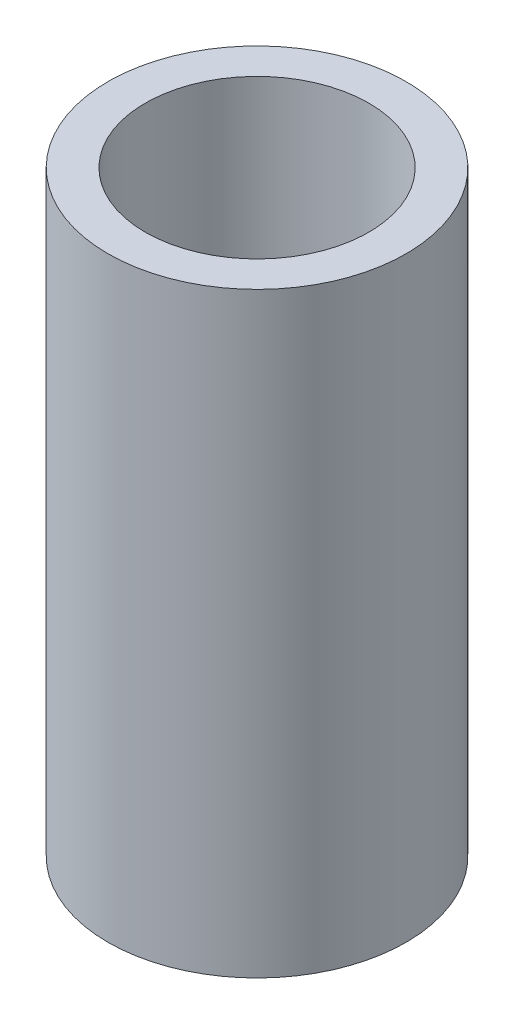
ISO-10303-21;
HEADER;
FILE_DESCRIPTION(('STEP AP214'),'2;1');
FILE_NAME('part.step','',(''),(''),'','','');
FILE_SCHEMA(('AUTOMOTIVE_DESIGN { 1 0 10303 214 1 1 1 1 }'));
ENDSEC;
DATA;
#1=APPLICATION_CONTEXT('core data for automotive mechanical design processes');
#2=APPLICATION_PROTOCOL_DEFINITION('international standard','automotive_design',2000,#1);
#3=PRODUCT_CONTEXT('',#1,'mechanical');
#4=PRODUCT('Part','Part','',(#3));
#5=PRODUCT_RELATED_PRODUCT_CATEGORY('part','',(#4));
#6=PRODUCT_DEFINITION_FORMATION('','',#4);
#7=PRODUCT_DEFINITION_CONTEXT('part definition',#1,'design');
#8=PRODUCT_DEFINITION('design','',#6,#7);
#9=PRODUCT_DEFINITION_SHAPE('','',#8);
#10=(LENGTH_UNIT() NAMED_UNIT(*) SI_UNIT(.MILLI.,.METRE.));
#11=(NAMED_UNIT(*) PLANE_ANGLE_UNIT() SI_UNIT($,.RADIAN.));
#12=(NAMED_UNIT(*) SI_UNIT($,.STERADIAN.) SOLID_ANGLE_UNIT());
#13=UNCERTAINTY_MEASURE_WITH_UNIT(LENGTH_MEASURE(1.E-05),#10,'distance_accuracy_value','');
#14=(GEOMETRIC_REPRESENTATION_CONTEXT(3) GLOBAL_UNCERTAINTY_ASSIGNED_CONTEXT((#13)) GLOBAL_UNIT_ASSIGNED_CONTEXT((#10,
#11,#12)) REPRESENTATION_CONTEXT('',''));
#15=CARTESIAN_POINT('',(0.,0.,0.));
#16=DIRECTION('',(0.,0.,1.));
#17=DIRECTION('',(1.,0.,0.));
#18=AXIS2_PLACEMENT_3D('',#15,#16,#17);
#19=CARTESIAN_POINT('',(0.,8.,0.));
#20=DIRECTION('',(0.,1.,0.));
#21=DIRECTION('',(0.,0.,1.));
#22=AXIS2_PLACEMENT_3D('',#19,#20,#21);
#23=PLANE('',#22);
#24=CARTESIAN_POINT('',(0.,8.,0.));
#25=DIRECTION('',(0.,1.,0.));
#26=DIRECTION('',(0.,0.,1.));
#27=AXIS2_PLACEMENT_3D('',#24,#25,#26);
#28=CIRCLE('',#27,2.);
#29=CARTESIAN_POINT('',(0.,8.,2.));
#30=VERTEX_POINT('',#29);
#31=EDGE_CURVE('E10',#30,#30,#28,.T.);
#32=ORIENTED_EDGE('',*,*,#31,.T.);
#33=EDGE_LOOP('',(#32));
#34=FACE_BOUND('',#33,.T.);
#35=CARTESIAN_POINT('',(0.,8.,0.));
#36=DIRECTION('',(0.,1.,0.));
#37=DIRECTION('',(0.,0.,1.));
#38=AXIS2_PLACEMENT_3D('',#35,#36,#37);
#39=CIRCLE('',#38,1.5);
#40=CARTESIAN_POINT('',(0.,8.,1.5));
#41=VERTEX_POINT('',#40);
#42=EDGE_CURVE('E41',#41,#41,#39,.T.);
#43=ORIENTED_EDGE('',*,*,#42,.F.);
#44=EDGE_LOOP('',(#43));
#45=FACE_BOUND('',#44,.T.);
#46=ADVANCED_FACE('F30',(#34,#45),#23,.T.);
#47=CARTESIAN_POINT('',(0.,0.,0.));
#48=DIRECTION('',(0.,1.,0.));
#49=DIRECTION('',(0.,0.,1.));
#50=AXIS2_PLACEMENT_3D('',#47,#48,#49);
#51=PLANE('',#50);
#52=CARTESIAN_POINT('',(0.,0.,0.));
#53=DIRECTION('',(0.,1.,0.));
#54=DIRECTION('',(0.,0.,1.));
#55=AXIS2_PLACEMENT_3D('',#52,#53,#54);
#56=CIRCLE('',#55,2.);
#57=CARTESIAN_POINT('',(0.,0.,2.));
#58=VERTEX_POINT('',#57);
#59=EDGE_CURVE('E34',#58,#58,#56,.T.);
#60=ORIENTED_EDGE('',*,*,#59,.F.);
#61=EDGE_LOOP('',(#60));
#62=FACE_BOUND('',#61,.T.);
#63=CARTESIAN_POINT('',(0.,0.,0.));
#64=DIRECTION('',(0.,1.,0.));
#65=DIRECTION('',(0.,0.,1.));
#66=AXIS2_PLACEMENT_3D('',#63,#64,#65);
#67=CIRCLE('',#66,1.5);
#68=CARTESIAN_POINT('',(0.,0.,1.5));
#69=VERTEX_POINT('',#68);
#70=EDGE_CURVE('E43',#69,#69,#67,.T.);
#71=ORIENTED_EDGE('',*,*,#70,.T.);
#72=EDGE_LOOP('',(#71));
#73=FACE_BOUND('',#72,.T.);
#74=ADVANCED_FACE('F53',(#62,#73),#51,.F.);
#75=CARTESIAN_POINT('',(0.,8.,0.));
#76=DIRECTION('',(0.,-1.,0.));
#77=DIRECTION('',(0.,0.,-1.));
#78=AXIS2_PLACEMENT_3D('',#75,#76,#77);
#79=CYLINDRICAL_SURFACE('',#78,2.);
#80=ORIENTED_EDGE('',*,*,#31,.F.);
#81=EDGE_LOOP('',(#80));
#82=FACE_BOUND('',#81,.T.);
#83=ORIENTED_EDGE('',*,*,#59,.T.);
#84=EDGE_LOOP('',(#83));
#85=FACE_BOUND('',#84,.T.);
#86=ADVANCED_FACE('F32',(#82,#85),#79,.T.);
#87=CARTESIAN_POINT('',(0.,8.,0.));
#88=DIRECTION('',(0.,-1.,0.));
#89=DIRECTION('',(0.,0.,-1.));
#90=AXIS2_PLACEMENT_3D('',#87,#88,#89);
#91=CYLINDRICAL_SURFACE('',#90,1.5);
#92=ORIENTED_EDGE('',*,*,#42,.T.);
#93=EDGE_LOOP('',(#92));
#94=FACE_BOUND('',#93,.T.);
#95=ORIENTED_EDGE('',*,*,#70,.F.);
#96=EDGE_LOOP('',(#95));
#97=FACE_BOUND('',#96,.T.);
#98=ADVANCED_FACE('F49',(#94,#97),#91,.F.);
#99=CLOSED_SHELL('',(#46,#74,#86,#98));
#100=MANIFOLD_SOLID_BREP('B2',#99);
#101=ADVANCED_BREP_SHAPE_REPRESENTATION('',(#18,#100),#14);
#102=SHAPE_DEFINITION_REPRESENTATION(#9,#101);
ENDSEC;
END-ISO-10303-21;
